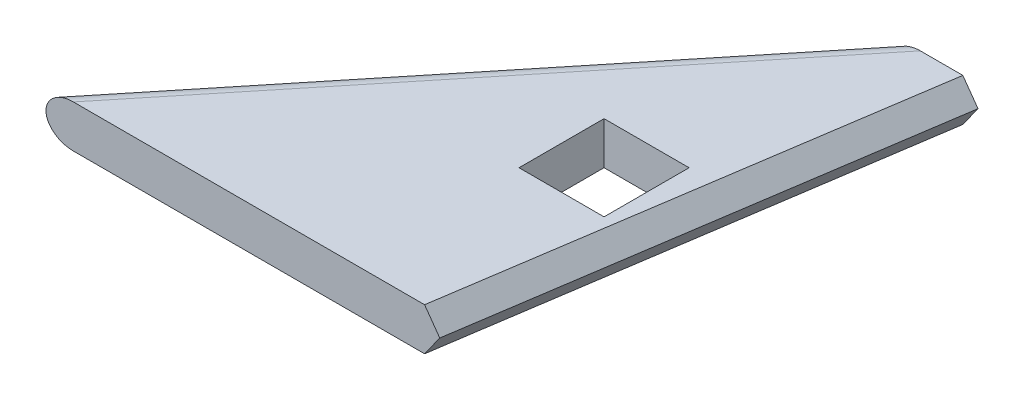
ISO-10303-21;
HEADER;
FILE_DESCRIPTION(('STEP AP214'),'2;1');
FILE_NAME('part.step','',(''),(''),'','','');
FILE_SCHEMA(('AUTOMOTIVE_DESIGN { 1 0 10303 214 1 1 1 1 }'));
ENDSEC;
DATA;
#1=APPLICATION_CONTEXT('core data for automotive mechanical design processes');
#2=APPLICATION_PROTOCOL_DEFINITION('international standard','automotive_design',2000,#1);
#3=PRODUCT_CONTEXT('',#1,'mechanical');
#4=PRODUCT('Part','Part','',(#3));
#5=PRODUCT_RELATED_PRODUCT_CATEGORY('part','',(#4));
#6=PRODUCT_DEFINITION_FORMATION('','',#4);
#7=PRODUCT_DEFINITION_CONTEXT('part definition',#1,'design');
#8=PRODUCT_DEFINITION('design','',#6,#7);
#9=PRODUCT_DEFINITION_SHAPE('','',#8);
#10=(LENGTH_UNIT() NAMED_UNIT(*) SI_UNIT(.MILLI.,.METRE.));
#11=(NAMED_UNIT(*) PLANE_ANGLE_UNIT() SI_UNIT($,.RADIAN.));
#12=(NAMED_UNIT(*) SI_UNIT($,.STERADIAN.) SOLID_ANGLE_UNIT());
#13=UNCERTAINTY_MEASURE_WITH_UNIT(LENGTH_MEASURE(1.E-05),#10,'distance_accuracy_value','');
#14=(GEOMETRIC_REPRESENTATION_CONTEXT(3) GLOBAL_UNCERTAINTY_ASSIGNED_CONTEXT((#13)) GLOBAL_UNIT_ASSIGNED_CONTEXT((#10,
#11,#12)) REPRESENTATION_CONTEXT('',''));
#15=CARTESIAN_POINT('',(0.,0.,0.));
#16=DIRECTION('',(0.,0.,1.));
#17=DIRECTION('',(1.,0.,0.));
#18=AXIS2_PLACEMENT_3D('',#15,#16,#17);
#19=CARTESIAN_POINT('',(0.,12.7,0.));
#20=DIRECTION('',(0.,0.,-1.));
#21=DIRECTION('',(-1.,0.,0.));
#22=AXIS2_PLACEMENT_3D('',#19,#20,#21);
#23=PLANE('',#22);
#24=DIRECTION('',(0.580339035424156,0.814374977490689,0.));
#25=VECTOR('',#24,1.);
#26=CARTESIAN_POINT('',(120.170633922716,9.95455730742003,0.));
#27=LINE('',#26,#25);
#28=CARTESIAN_POINT('',(113.076827819215,0.,0.));
#29=VERTEX_POINT('',#28);
#30=CARTESIAN_POINT('',(117.601958105386,6.35,0.));
#31=VERTEX_POINT('',#30);
#32=EDGE_CURVE('E61',#29,#31,#27,.T.);
#33=ORIENTED_EDGE('',*,*,#32,.T.);
#34=DIRECTION('',(-0.580339035424156,0.814374977490689,0.));
#35=VECTOR('',#34,1.);
#36=CARTESIAN_POINT('',(124.695764208888,-3.60455730742003,0.));
#37=LINE('',#36,#35);
#38=CARTESIAN_POINT('',(113.076827819215,12.7,0.));
#39=VERTEX_POINT('',#38);
#40=EDGE_CURVE('E168',#31,#39,#37,.T.);
#41=ORIENTED_EDGE('',*,*,#40,.T.);
#42=DIRECTION('',(1.,0.,0.));
#43=VECTOR('',#42,1.);
#44=CARTESIAN_POINT('',(0.,12.7,0.));
#45=LINE('',#44,#43);
#46=CARTESIAN_POINT('',(8.17486971382844,12.7,0.));
#47=VERTEX_POINT('',#46);
#48=EDGE_CURVE('E141',#47,#39,#45,.T.);
#49=ORIENTED_EDGE('',*,*,#48,.F.);
#50=CARTESIAN_POINT('',(8.17486971382844,6.35,0.));
#51=DIRECTION('',(0.,0.,-1.));
#52=DIRECTION('',(1.,0.,0.));
#53=AXIS2_PLACEMENT_3D('',#50,#51,#52);
#54=ELLIPSE('',#53,8.17486971382844,6.35);
#55=CARTESIAN_POINT('',(0.,6.35,0.));
#56=VERTEX_POINT('',#55);
#57=EDGE_CURVE('E69',#47,#56,#54,.F.);
#58=ORIENTED_EDGE('',*,*,#57,.T.);
#59=CARTESIAN_POINT('',(8.17486971382844,6.35,0.));
#60=DIRECTION('',(0.,0.,-1.));
#61=DIRECTION('',(-1.,0.,0.));
#62=AXIS2_PLACEMENT_3D('',#59,#60,#61);
#63=ELLIPSE('',#62,8.17486971382844,6.35);
#64=CARTESIAN_POINT('',(8.17486971382843,0.,0.));
#65=VERTEX_POINT('',#64);
#66=EDGE_CURVE('E157',#56,#65,#63,.F.);
#67=ORIENTED_EDGE('',*,*,#66,.T.);
#68=DIRECTION('',(1.,0.,0.));
#69=VECTOR('',#68,1.);
#70=CARTESIAN_POINT('',(0.,0.,0.));
#71=LINE('',#70,#69);
#72=EDGE_CURVE('E142',#65,#29,#71,.T.);
#73=ORIENTED_EDGE('',*,*,#72,.T.);
#74=EDGE_LOOP('',(#33,#41,#49,#58,#67,#73));
#75=FACE_BOUND('',#74,.T.);
#76=ADVANCED_FACE('F46',(#75),#23,.F.);
#77=CARTESIAN_POINT('',(0.,12.7,-139.7));
#78=DIRECTION('',(0.,0.,-1.));
#79=DIRECTION('',(-1.,0.,0.));
#80=AXIS2_PLACEMENT_3D('',#77,#78,#79);
#81=PLANE('',#80);
#82=DIRECTION('',(-0.580339035424156,0.814374977490689,0.));
#83=VECTOR('',#82,1.);
#84=CARTESIAN_POINT('',(138.664740769692,6.35,-139.7));
#85=LINE('',#84,#83);
#86=CARTESIAN_POINT('',(138.664740769692,6.35,-139.7));
#87=VERTEX_POINT('',#86);
#88=CARTESIAN_POINT('',(134.139610483521,12.7,-139.7));
#89=VERTEX_POINT('',#88);
#90=EDGE_CURVE('E135',#87,#89,#85,.T.);
#91=ORIENTED_EDGE('',*,*,#90,.F.);
#92=DIRECTION('',(0.580339035424156,0.814374977490689,0.));
#93=VECTOR('',#92,1.);
#94=CARTESIAN_POINT('',(134.139610483521,0.,-139.7));
#95=LINE('',#94,#93);
#96=CARTESIAN_POINT('',(134.139610483521,0.,-139.7));
#97=VERTEX_POINT('',#96);
#98=EDGE_CURVE('E123',#97,#87,#95,.T.);
#99=ORIENTED_EDGE('',*,*,#98,.F.);
#100=DIRECTION('',(1.,0.,0.));
#101=VECTOR('',#100,1.);
#102=CARTESIAN_POINT('',(0.,0.,-139.7));
#103=LINE('',#102,#101);
#104=CARTESIAN_POINT('',(121.439610483521,0.,-139.7));
#105=VERTEX_POINT('',#104);
#106=EDGE_CURVE('E133',#105,#97,#103,.T.);
#107=ORIENTED_EDGE('',*,*,#106,.F.);
#108=CARTESIAN_POINT('',(121.439610483521,6.35,-139.7));
#109=DIRECTION('',(0.,0.,-1.));
#110=DIRECTION('',(-1.,0.,0.));
#111=AXIS2_PLACEMENT_3D('',#108,#109,#110);
#112=ELLIPSE('',#111,8.17486971382844,6.35);
#113=CARTESIAN_POINT('',(113.264740769692,6.35,-139.7));
#114=VERTEX_POINT('',#113);
#115=EDGE_CURVE('E154',#105,#114,#112,.T.);
#116=ORIENTED_EDGE('',*,*,#115,.T.);
#117=CARTESIAN_POINT('',(121.439610483521,6.35,-139.7));
#118=DIRECTION('',(0.,0.,-1.));
#119=DIRECTION('',(1.,0.,0.));
#120=AXIS2_PLACEMENT_3D('',#117,#118,#119);
#121=ELLIPSE('',#120,8.17486971382844,6.35);
#122=CARTESIAN_POINT('',(121.439610483521,12.7,-139.7));
#123=VERTEX_POINT('',#122);
#124=EDGE_CURVE('E152',#114,#123,#121,.T.);
#125=ORIENTED_EDGE('',*,*,#124,.T.);
#126=DIRECTION('',(1.,0.,0.));
#127=VECTOR('',#126,1.);
#128=CARTESIAN_POINT('',(0.,12.7,-139.7));
#129=LINE('',#128,#127);
#130=EDGE_CURVE('E145',#123,#89,#129,.T.);
#131=ORIENTED_EDGE('',*,*,#130,.T.);
#132=EDGE_LOOP('',(#91,#99,#107,#116,#125,#131));
#133=FACE_BOUND('',#132,.T.);
#134=ADVANCED_FACE('F132',(#133),#81,.T.);
#135=CARTESIAN_POINT('',(0.,12.7,0.));
#136=DIRECTION('',(0.,1.,0.));
#137=DIRECTION('',(0.,0.,1.));
#138=AXIS2_PLACEMENT_3D('',#135,#136,#137);
#139=PLANE('',#138);
#140=DIRECTION('',(-0.149086529983767,0.,0.988824153516387));
#141=VECTOR('',#140,1.);
#142=CARTESIAN_POINT('',(110.563492526394,12.7,16.6698268696499));
#143=LINE('',#142,#141);
#144=EDGE_CURVE('E11',#89,#39,#143,.T.);
#145=ORIENTED_EDGE('',*,*,#144,.F.);
#146=ORIENTED_EDGE('',*,*,#130,.F.);
#147=DIRECTION('',(0.629783407924456,0.,-0.776770789295696));
#148=VECTOR('',#147,1.);
#149=CARTESIAN_POINT('',(4.93249451202767,12.7,3.99912464032029));
#150=LINE('',#149,#148);
#151=EDGE_CURVE('E129',#123,#47,#150,.F.);
#152=ORIENTED_EDGE('',*,*,#151,.T.);
#153=ORIENTED_EDGE('',*,*,#48,.T.);
#154=EDGE_LOOP('',(#145,#146,#152,#153));
#155=FACE_BOUND('',#154,.T.);
#156=DIRECTION('',(0.,0.,1.));
#157=VECTOR('',#156,1.);
#158=CARTESIAN_POINT('',(91.7478703848462,12.7,-74.93));
#159=LINE('',#158,#157);
#160=CARTESIAN_POINT('',(91.7478703848462,12.7,-74.93));
#161=VERTEX_POINT('',#160);
#162=CARTESIAN_POINT('',(91.7478703848462,12.7,-49.53));
#163=VERTEX_POINT('',#162);
#164=EDGE_CURVE('E162',#161,#163,#159,.T.);
#165=ORIENTED_EDGE('',*,*,#164,.F.);
#166=DIRECTION('',(-1.,0.,0.));
#167=VECTOR('',#166,1.);
#168=CARTESIAN_POINT('',(91.7478703848462,12.7,-74.93));
#169=LINE('',#168,#167);
#170=CARTESIAN_POINT('',(117.147870384846,12.7,-74.93));
#171=VERTEX_POINT('',#170);
#172=EDGE_CURVE('E181',#171,#161,#169,.T.);
#173=ORIENTED_EDGE('',*,*,#172,.F.);
#174=DIRECTION('',(0.,0.,-1.));
#175=VECTOR('',#174,1.);
#176=CARTESIAN_POINT('',(117.147870384846,12.7,-74.93));
#177=LINE('',#176,#175);
#178=CARTESIAN_POINT('',(117.147870384846,12.7,-49.53));
#179=VERTEX_POINT('',#178);
#180=EDGE_CURVE('E193',#179,#171,#177,.T.);
#181=ORIENTED_EDGE('',*,*,#180,.F.);
#182=DIRECTION('',(1.,0.,0.));
#183=VECTOR('',#182,1.);
#184=CARTESIAN_POINT('',(91.7478703848462,12.7,-49.53));
#185=LINE('',#184,#183);
#186=EDGE_CURVE('E166',#163,#179,#185,.T.);
#187=ORIENTED_EDGE('',*,*,#186,.F.);
#188=EDGE_LOOP('',(#165,#173,#181,#187));
#189=FACE_BOUND('',#188,.T.);
#190=ADVANCED_FACE('F209',(#155,#189),#139,.T.);
#191=CARTESIAN_POINT('',(0.,0.,0.));
#192=DIRECTION('',(0.,1.,0.));
#193=DIRECTION('',(0.,0.,1.));
#194=AXIS2_PLACEMENT_3D('',#191,#192,#193);
#195=PLANE('',#194);
#196=DIRECTION('',(-1.,0.,0.));
#197=VECTOR('',#196,1.);
#198=CARTESIAN_POINT('',(91.7478703848462,0.,-74.93));
#199=LINE('',#198,#197);
#200=CARTESIAN_POINT('',(117.147870384846,0.,-74.93));
#201=VERTEX_POINT('',#200);
#202=CARTESIAN_POINT('',(91.7478703848462,0.,-74.93));
#203=VERTEX_POINT('',#202);
#204=EDGE_CURVE('E187',#201,#203,#199,.T.);
#205=ORIENTED_EDGE('',*,*,#204,.T.);
#206=DIRECTION('',(0.,0.,1.));
#207=VECTOR('',#206,1.);
#208=CARTESIAN_POINT('',(91.7478703848462,0.,-74.93));
#209=LINE('',#208,#207);
#210=CARTESIAN_POINT('',(91.7478703848462,0.,-49.53));
#211=VERTEX_POINT('',#210);
#212=EDGE_CURVE('E177',#203,#211,#209,.T.);
#213=ORIENTED_EDGE('',*,*,#212,.T.);
#214=DIRECTION('',(1.,0.,0.));
#215=VECTOR('',#214,1.);
#216=CARTESIAN_POINT('',(91.7478703848462,0.,-49.53));
#217=LINE('',#216,#215);
#218=CARTESIAN_POINT('',(117.147870384846,0.,-49.53));
#219=VERTEX_POINT('',#218);
#220=EDGE_CURVE('E180',#211,#219,#217,.T.);
#221=ORIENTED_EDGE('',*,*,#220,.T.);
#222=DIRECTION('',(0.,0.,-1.));
#223=VECTOR('',#222,1.);
#224=CARTESIAN_POINT('',(117.147870384846,0.,-74.93));
#225=LINE('',#224,#223);
#226=EDGE_CURVE('E184',#219,#201,#225,.T.);
#227=ORIENTED_EDGE('',*,*,#226,.T.);
#228=EDGE_LOOP('',(#205,#213,#221,#227));
#229=FACE_BOUND('',#228,.T.);
#230=ORIENTED_EDGE('',*,*,#106,.T.);
#231=DIRECTION('',(-0.149086529983767,0.,0.988824153516387));
#232=VECTOR('',#231,1.);
#233=CARTESIAN_POINT('',(110.563492526394,0.,16.6698268696499));
#234=LINE('',#233,#232);
#235=EDGE_CURVE('E54',#97,#29,#234,.T.);
#236=ORIENTED_EDGE('',*,*,#235,.T.);
#237=ORIENTED_EDGE('',*,*,#72,.F.);
#238=DIRECTION('',(0.629783407924456,0.,-0.776770789295696));
#239=VECTOR('',#238,1.);
#240=CARTESIAN_POINT('',(118.19723528172,0.,-135.70087535968));
#241=LINE('',#240,#239);
#242=EDGE_CURVE('E140',#65,#105,#241,.T.);
#243=ORIENTED_EDGE('',*,*,#242,.T.);
#244=EDGE_LOOP('',(#230,#236,#237,#243));
#245=FACE_BOUND('',#244,.T.);
#246=ADVANCED_FACE('F138',(#229,#245),#195,.F.);
#247=CARTESIAN_POINT('',(91.7478703848462,0.,-74.93));
#248=DIRECTION('',(-1.,0.,0.));
#249=DIRECTION('',(0.,0.,1.));
#250=AXIS2_PLACEMENT_3D('',#247,#248,#249);
#251=PLANE('',#250);
#252=ORIENTED_EDGE('',*,*,#164,.T.);
#253=DIRECTION('',(0.,1.,0.));
#254=VECTOR('',#253,1.);
#255=CARTESIAN_POINT('',(91.7478703848462,0.,-49.53));
#256=LINE('',#255,#254);
#257=EDGE_CURVE('E189',#211,#163,#256,.T.);
#258=ORIENTED_EDGE('',*,*,#257,.F.);
#259=ORIENTED_EDGE('',*,*,#212,.F.);
#260=DIRECTION('',(0.,1.,0.));
#261=VECTOR('',#260,1.);
#262=CARTESIAN_POINT('',(91.7478703848462,0.,-74.93));
#263=LINE('',#262,#261);
#264=EDGE_CURVE('E147',#203,#161,#263,.T.);
#265=ORIENTED_EDGE('',*,*,#264,.T.);
#266=EDGE_LOOP('',(#252,#258,#259,#265));
#267=FACE_BOUND('',#266,.T.);
#268=ADVANCED_FACE('F246',(#267),#251,.F.);
#269=CARTESIAN_POINT('',(91.7478703848462,0.,-74.93));
#270=DIRECTION('',(0.,0.,-1.));
#271=DIRECTION('',(-1.,0.,0.));
#272=AXIS2_PLACEMENT_3D('',#269,#270,#271);
#273=PLANE('',#272);
#274=ORIENTED_EDGE('',*,*,#172,.T.);
#275=ORIENTED_EDGE('',*,*,#264,.F.);
#276=ORIENTED_EDGE('',*,*,#204,.F.);
#277=DIRECTION('',(0.,1.,0.));
#278=VECTOR('',#277,1.);
#279=CARTESIAN_POINT('',(117.147870384846,0.,-74.93));
#280=LINE('',#279,#278);
#281=EDGE_CURVE('E199',#201,#171,#280,.T.);
#282=ORIENTED_EDGE('',*,*,#281,.T.);
#283=EDGE_LOOP('',(#274,#275,#276,#282));
#284=FACE_BOUND('',#283,.T.);
#285=ADVANCED_FACE('F242',(#284),#273,.F.);
#286=CARTESIAN_POINT('',(117.147870384846,0.,-74.93));
#287=DIRECTION('',(1.,0.,0.));
#288=DIRECTION('',(0.,0.,-1.));
#289=AXIS2_PLACEMENT_3D('',#286,#287,#288);
#290=PLANE('',#289);
#291=ORIENTED_EDGE('',*,*,#180,.T.);
#292=ORIENTED_EDGE('',*,*,#281,.F.);
#293=ORIENTED_EDGE('',*,*,#226,.F.);
#294=DIRECTION('',(0.,1.,0.));
#295=VECTOR('',#294,1.);
#296=CARTESIAN_POINT('',(117.147870384846,0.,-49.53));
#297=LINE('',#296,#295);
#298=EDGE_CURVE('E201',#219,#179,#297,.T.);
#299=ORIENTED_EDGE('',*,*,#298,.T.);
#300=EDGE_LOOP('',(#291,#292,#293,#299));
#301=FACE_BOUND('',#300,.T.);
#302=ADVANCED_FACE('F236',(#301),#290,.F.);
#303=CARTESIAN_POINT('',(91.7478703848462,0.,-49.53));
#304=DIRECTION('',(0.,0.,1.));
#305=DIRECTION('',(1.,0.,0.));
#306=AXIS2_PLACEMENT_3D('',#303,#304,#305);
#307=PLANE('',#306);
#308=ORIENTED_EDGE('',*,*,#186,.T.);
#309=ORIENTED_EDGE('',*,*,#298,.F.);
#310=ORIENTED_EDGE('',*,*,#220,.F.);
#311=ORIENTED_EDGE('',*,*,#257,.T.);
#312=EDGE_LOOP('',(#308,#309,#310,#311));
#313=FACE_BOUND('',#312,.T.);
#314=ADVANCED_FACE('F232',(#313),#307,.F.);
#315=CARTESIAN_POINT('',(4.93249451202767,6.35,3.99912464032029));
#316=DIRECTION('',(0.629783407924456,0.,-0.776770789295696));
#317=DIRECTION('',(-0.776770789295696,0.,-0.629783407924456));
#318=AXIS2_PLACEMENT_3D('',#315,#316,#317);
#319=CYLINDRICAL_SURFACE('',#318,6.35);
#320=DIRECTION('',(0.629783407924456,0.,-0.776770789295696));
#321=VECTOR('',#320,1.);
#322=CARTESIAN_POINT('',(0.,6.35,0.));
#323=LINE('',#322,#321);
#324=EDGE_CURVE('E160',#56,#114,#323,.T.);
#325=ORIENTED_EDGE('',*,*,#324,.F.);
#326=ORIENTED_EDGE('',*,*,#57,.F.);
#327=ORIENTED_EDGE('',*,*,#151,.F.);
#328=ORIENTED_EDGE('',*,*,#124,.F.);
#329=EDGE_LOOP('',(#325,#326,#327,#328));
#330=FACE_BOUND('',#329,.T.);
#331=ADVANCED_FACE('F48',(#330),#319,.T.);
#332=CARTESIAN_POINT('',(4.93249451202767,6.35,3.99912464032029));
#333=DIRECTION('',(-0.629783407924456,0.,0.776770789295696));
#334=DIRECTION('',(0.776770789295696,0.,0.629783407924456));
#335=AXIS2_PLACEMENT_3D('',#332,#333,#334);
#336=CYLINDRICAL_SURFACE('',#335,6.35);
#337=ORIENTED_EDGE('',*,*,#66,.F.);
#338=ORIENTED_EDGE('',*,*,#324,.T.);
#339=ORIENTED_EDGE('',*,*,#115,.F.);
#340=ORIENTED_EDGE('',*,*,#242,.F.);
#341=EDGE_LOOP('',(#337,#338,#339,#340));
#342=FACE_BOUND('',#341,.T.);
#343=ADVANCED_FACE('F212',(#342),#336,.T.);
#344=CARTESIAN_POINT('',(134.139610483521,0.,-139.7));
#345=DIRECTION('',(-0.808304749901372,0.576013276257483,-0.121869343405147));
#346=DIRECTION('',(-0.580339035424156,-0.814374977490689,0.));
#347=AXIS2_PLACEMENT_3D('',#344,#345,#346);
#348=PLANE('',#347);
#349=ORIENTED_EDGE('',*,*,#98,.T.);
#350=DIRECTION('',(0.149086529983767,0.,-0.988824153516387));
#351=VECTOR('',#350,1.);
#352=CARTESIAN_POINT('',(138.664740769692,6.35,-139.7));
#353=LINE('',#352,#351);
#354=EDGE_CURVE('E163',#31,#87,#353,.T.);
#355=ORIENTED_EDGE('',*,*,#354,.F.);
#356=ORIENTED_EDGE('',*,*,#32,.F.);
#357=ORIENTED_EDGE('',*,*,#235,.F.);
#358=EDGE_LOOP('',(#349,#355,#356,#357));
#359=FACE_BOUND('',#358,.T.);
#360=ADVANCED_FACE('F122',(#359),#348,.F.);
#361=CARTESIAN_POINT('',(138.664740769692,6.35,-139.7));
#362=DIRECTION('',(-0.808304749901372,-0.576013276257483,-0.121869343405147));
#363=DIRECTION('',(0.580339035424156,-0.814374977490689,0.));
#364=AXIS2_PLACEMENT_3D('',#361,#362,#363);
#365=PLANE('',#364);
#366=ORIENTED_EDGE('',*,*,#144,.T.);
#367=ORIENTED_EDGE('',*,*,#40,.F.);
#368=ORIENTED_EDGE('',*,*,#354,.T.);
#369=ORIENTED_EDGE('',*,*,#90,.T.);
#370=EDGE_LOOP('',(#366,#367,#368,#369));
#371=FACE_BOUND('',#370,.T.);
#372=ADVANCED_FACE('F213',(#371),#365,.F.);
#373=CLOSED_SHELL('',(#76,#134,#190,#246,#268,#285,#302,#314,#331,#343,#360,#372));
#374=MANIFOLD_SOLID_BREP('B2',#373);
#375=ADVANCED_BREP_SHAPE_REPRESENTATION('',(#18,#374),#14);
#376=SHAPE_DEFINITION_REPRESENTATION(#9,#375);
ENDSEC;
END-ISO-10303-21;
